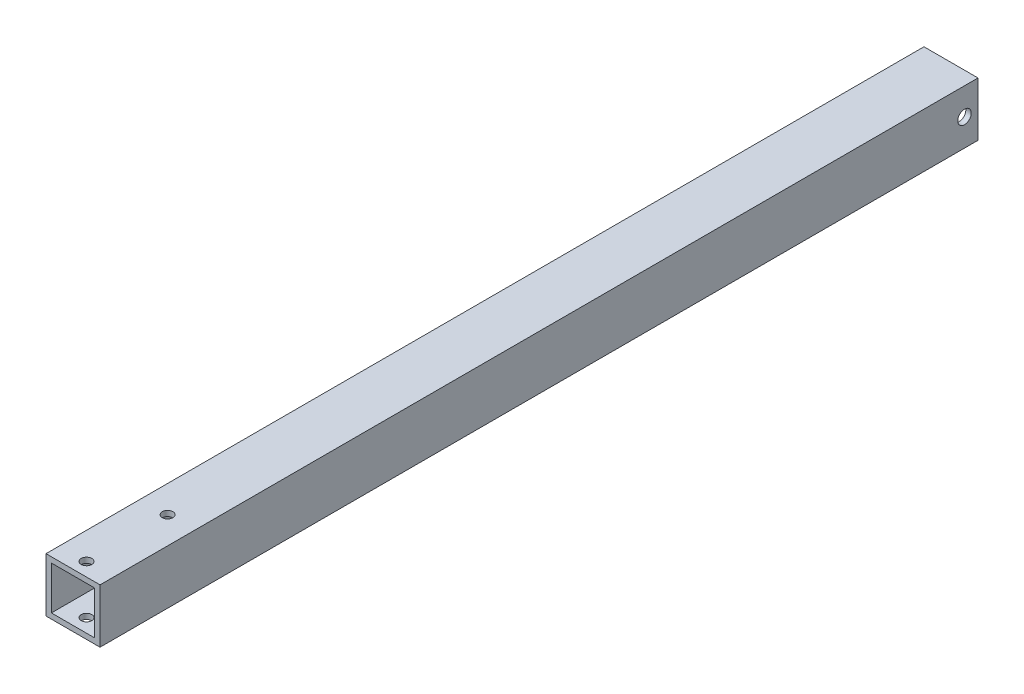
ISO-10303-21;
HEADER;
FILE_DESCRIPTION(('STEP AP214'),'2;1');
FILE_NAME('part.step','',(''),(''),'','','');
FILE_SCHEMA(('AUTOMOTIVE_DESIGN { 1 0 10303 214 1 1 1 1 }'));
ENDSEC;
DATA;
#1=APPLICATION_CONTEXT('core data for automotive mechanical design processes');
#2=APPLICATION_PROTOCOL_DEFINITION('international standard','automotive_design',2000,#1);
#3=PRODUCT_CONTEXT('',#1,'mechanical');
#4=PRODUCT('Part','Part','',(#3));
#5=PRODUCT_RELATED_PRODUCT_CATEGORY('part','',(#4));
#6=PRODUCT_DEFINITION_FORMATION('','',#4);
#7=PRODUCT_DEFINITION_CONTEXT('part definition',#1,'design');
#8=PRODUCT_DEFINITION('design','',#6,#7);
#9=PRODUCT_DEFINITION_SHAPE('','',#8);
#10=(LENGTH_UNIT() NAMED_UNIT(*) SI_UNIT(.MILLI.,.METRE.));
#11=(NAMED_UNIT(*) PLANE_ANGLE_UNIT() SI_UNIT($,.RADIAN.));
#12=(NAMED_UNIT(*) SI_UNIT($,.STERADIAN.) SOLID_ANGLE_UNIT());
#13=UNCERTAINTY_MEASURE_WITH_UNIT(LENGTH_MEASURE(1.E-05),#10,'distance_accuracy_value','');
#14=(GEOMETRIC_REPRESENTATION_CONTEXT(3) GLOBAL_UNCERTAINTY_ASSIGNED_CONTEXT((#13)) GLOBAL_UNIT_ASSIGNED_CONTEXT((#10,
#11,#12)) REPRESENTATION_CONTEXT('',''));
#15=CARTESIAN_POINT('',(0.,0.,0.));
#16=DIRECTION('',(0.,0.,1.));
#17=DIRECTION('',(1.,0.,0.));
#18=AXIS2_PLACEMENT_3D('',#15,#16,#17);
#19=CARTESIAN_POINT('',(0.,0.,412.75));
#20=DIRECTION('',(0.,0.,1.));
#21=DIRECTION('',(1.,0.,0.));
#22=AXIS2_PLACEMENT_3D('',#19,#20,#21);
#23=PLANE('',#22);
#24=DIRECTION('',(0.,1.,0.));
#25=VECTOR('',#24,1.);
#26=CARTESIAN_POINT('',(12.7,12.7,412.75));
#27=LINE('',#26,#25);
#28=CARTESIAN_POINT('',(12.7,-12.7,412.75));
#29=VERTEX_POINT('',#28);
#30=CARTESIAN_POINT('',(12.7,12.7,412.75));
#31=VERTEX_POINT('',#30);
#32=EDGE_CURVE('E163',#29,#31,#27,.T.);
#33=ORIENTED_EDGE('',*,*,#32,.T.);
#34=DIRECTION('',(-1.,0.,0.));
#35=VECTOR('',#34,1.);
#36=CARTESIAN_POINT('',(-12.7,12.7,412.75));
#37=LINE('',#36,#35);
#38=CARTESIAN_POINT('',(-12.7,12.7,412.75));
#39=VERTEX_POINT('',#38);
#40=EDGE_CURVE('E166',#31,#39,#37,.T.);
#41=ORIENTED_EDGE('',*,*,#40,.T.);
#42=DIRECTION('',(0.,-1.,0.));
#43=VECTOR('',#42,1.);
#44=CARTESIAN_POINT('',(-12.7,12.7,412.75));
#45=LINE('',#44,#43);
#46=CARTESIAN_POINT('',(-12.7,-12.7,412.75));
#47=VERTEX_POINT('',#46);
#48=EDGE_CURVE('E169',#39,#47,#45,.T.);
#49=ORIENTED_EDGE('',*,*,#48,.T.);
#50=DIRECTION('',(1.,0.,0.));
#51=VECTOR('',#50,1.);
#52=CARTESIAN_POINT('',(-12.7,-12.7,412.75));
#53=LINE('',#52,#51);
#54=EDGE_CURVE('E171',#47,#29,#53,.T.);
#55=ORIENTED_EDGE('',*,*,#54,.T.);
#56=EDGE_LOOP('',(#33,#41,#49,#55));
#57=FACE_BOUND('',#56,.T.);
#58=DIRECTION('',(-1.,0.,0.));
#59=VECTOR('',#58,1.);
#60=CARTESIAN_POINT('',(-12.7,10.16,412.75));
#61=LINE('',#60,#59);
#62=CARTESIAN_POINT('',(10.16,10.16,412.75));
#63=VERTEX_POINT('',#62);
#64=CARTESIAN_POINT('',(-10.16,10.16,412.75));
#65=VERTEX_POINT('',#64);
#66=EDGE_CURVE('E133',#63,#65,#61,.T.);
#67=ORIENTED_EDGE('',*,*,#66,.F.);
#68=DIRECTION('',(0.,1.,0.));
#69=VECTOR('',#68,1.);
#70=CARTESIAN_POINT('',(10.16,12.7,412.75));
#71=LINE('',#70,#69);
#72=CARTESIAN_POINT('',(10.16,-10.16,412.75));
#73=VERTEX_POINT('',#72);
#74=EDGE_CURVE('E125',#73,#63,#71,.T.);
#75=ORIENTED_EDGE('',*,*,#74,.F.);
#76=DIRECTION('',(1.,0.,0.));
#77=VECTOR('',#76,1.);
#78=CARTESIAN_POINT('',(-12.7,-10.16,412.75));
#79=LINE('',#78,#77);
#80=CARTESIAN_POINT('',(-10.16,-10.16,412.75));
#81=VERTEX_POINT('',#80);
#82=EDGE_CURVE('E147',#81,#73,#79,.T.);
#83=ORIENTED_EDGE('',*,*,#82,.F.);
#84=DIRECTION('',(0.,-1.,0.));
#85=VECTOR('',#84,1.);
#86=CARTESIAN_POINT('',(-10.16,12.7,412.75));
#87=LINE('',#86,#85);
#88=EDGE_CURVE('E145',#65,#81,#87,.T.);
#89=ORIENTED_EDGE('',*,*,#88,.F.);
#90=EDGE_LOOP('',(#67,#75,#83,#89));
#91=FACE_BOUND('',#90,.T.);
#92=ADVANCED_FACE('F58',(#57,#91),#23,.T.);
#93=CARTESIAN_POINT('',(0.,0.,0.));
#94=DIRECTION('',(0.,0.,1.));
#95=DIRECTION('',(1.,0.,0.));
#96=AXIS2_PLACEMENT_3D('',#93,#94,#95);
#97=PLANE('',#96);
#98=DIRECTION('',(0.,1.,0.));
#99=VECTOR('',#98,1.);
#100=CARTESIAN_POINT('',(12.7,12.7,0.));
#101=LINE('',#100,#99);
#102=CARTESIAN_POINT('',(12.7,-12.7,0.));
#103=VERTEX_POINT('',#102);
#104=CARTESIAN_POINT('',(12.7,12.7,0.));
#105=VERTEX_POINT('',#104);
#106=EDGE_CURVE('E141',#103,#105,#101,.T.);
#107=ORIENTED_EDGE('',*,*,#106,.F.);
#108=DIRECTION('',(1.,0.,0.));
#109=VECTOR('',#108,1.);
#110=CARTESIAN_POINT('',(-12.7,-12.7,0.));
#111=LINE('',#110,#109);
#112=CARTESIAN_POINT('',(-12.7,-12.7,0.));
#113=VERTEX_POINT('',#112);
#114=EDGE_CURVE('E167',#113,#103,#111,.T.);
#115=ORIENTED_EDGE('',*,*,#114,.F.);
#116=DIRECTION('',(0.,-1.,0.));
#117=VECTOR('',#116,1.);
#118=CARTESIAN_POINT('',(-12.7,12.7,0.));
#119=LINE('',#118,#117);
#120=CARTESIAN_POINT('',(-12.7,12.7,0.));
#121=VERTEX_POINT('',#120);
#122=EDGE_CURVE('E178',#121,#113,#119,.T.);
#123=ORIENTED_EDGE('',*,*,#122,.F.);
#124=DIRECTION('',(-1.,0.,0.));
#125=VECTOR('',#124,1.);
#126=CARTESIAN_POINT('',(-12.7,12.7,0.));
#127=LINE('',#126,#125);
#128=EDGE_CURVE('E176',#105,#121,#127,.T.);
#129=ORIENTED_EDGE('',*,*,#128,.F.);
#130=EDGE_LOOP('',(#107,#115,#123,#129));
#131=FACE_BOUND('',#130,.T.);
#132=DIRECTION('',(0.,1.,0.));
#133=VECTOR('',#132,1.);
#134=CARTESIAN_POINT('',(10.16,12.7,0.));
#135=LINE('',#134,#133);
#136=CARTESIAN_POINT('',(10.16,-10.16,0.));
#137=VERTEX_POINT('',#136);
#138=CARTESIAN_POINT('',(10.16,10.16,0.));
#139=VERTEX_POINT('',#138);
#140=EDGE_CURVE('E83',#137,#139,#135,.T.);
#141=ORIENTED_EDGE('',*,*,#140,.T.);
#142=DIRECTION('',(-1.,0.,0.));
#143=VECTOR('',#142,1.);
#144=CARTESIAN_POINT('',(-12.7,10.16,0.));
#145=LINE('',#144,#143);
#146=CARTESIAN_POINT('',(-10.16,10.16,0.));
#147=VERTEX_POINT('',#146);
#148=EDGE_CURVE('E140',#139,#147,#145,.T.);
#149=ORIENTED_EDGE('',*,*,#148,.T.);
#150=DIRECTION('',(0.,-1.,0.));
#151=VECTOR('',#150,1.);
#152=CARTESIAN_POINT('',(-10.16,12.7,0.));
#153=LINE('',#152,#151);
#154=CARTESIAN_POINT('',(-10.16,-10.16,0.));
#155=VERTEX_POINT('',#154);
#156=EDGE_CURVE('E155',#147,#155,#153,.T.);
#157=ORIENTED_EDGE('',*,*,#156,.T.);
#158=DIRECTION('',(1.,0.,0.));
#159=VECTOR('',#158,1.);
#160=CARTESIAN_POINT('',(-12.7,-10.16,0.));
#161=LINE('',#160,#159);
#162=EDGE_CURVE('E134',#155,#137,#161,.T.);
#163=ORIENTED_EDGE('',*,*,#162,.T.);
#164=EDGE_LOOP('',(#141,#149,#157,#163));
#165=FACE_BOUND('',#164,.T.);
#166=ADVANCED_FACE('F236',(#131,#165),#97,.F.);
#167=CARTESIAN_POINT('',(12.7,12.7,412.75));
#168=DIRECTION('',(-1.,0.,0.));
#169=DIRECTION('',(0.,-1.,0.));
#170=AXIS2_PLACEMENT_3D('',#167,#168,#169);
#171=PLANE('',#170);
#172=CARTESIAN_POINT('',(12.7,0.,6.35));
#173=DIRECTION('',(1.,0.,0.));
#174=DIRECTION('',(0.,1.,0.));
#175=AXIS2_PLACEMENT_3D('',#172,#173,#174);
#176=CIRCLE('',#175,3.175);
#177=CARTESIAN_POINT('',(12.7,3.175,6.35));
#178=VERTEX_POINT('',#177);
#179=EDGE_CURVE('E216',#178,#178,#176,.T.);
#180=ORIENTED_EDGE('',*,*,#179,.F.);
#181=EDGE_LOOP('',(#180));
#182=FACE_BOUND('',#181,.T.);
#183=ORIENTED_EDGE('',*,*,#106,.T.);
#184=DIRECTION('',(0.,0.,-1.));
#185=VECTOR('',#184,1.);
#186=CARTESIAN_POINT('',(12.7,12.7,412.75));
#187=LINE('',#186,#185);
#188=EDGE_CURVE('E12',#31,#105,#187,.T.);
#189=ORIENTED_EDGE('',*,*,#188,.F.);
#190=ORIENTED_EDGE('',*,*,#32,.F.);
#191=DIRECTION('',(0.,0.,-1.));
#192=VECTOR('',#191,1.);
#193=CARTESIAN_POINT('',(12.7,-12.7,412.75));
#194=LINE('',#193,#192);
#195=EDGE_CURVE('E173',#29,#103,#194,.T.);
#196=ORIENTED_EDGE('',*,*,#195,.T.);
#197=EDGE_LOOP('',(#183,#189,#190,#196));
#198=FACE_BOUND('',#197,.T.);
#199=ADVANCED_FACE('F60',(#182,#198),#171,.F.);
#200=CARTESIAN_POINT('',(-12.7,12.7,412.75));
#201=DIRECTION('',(0.,-1.,0.));
#202=DIRECTION('',(0.,0.,-1.));
#203=AXIS2_PLACEMENT_3D('',#200,#201,#202);
#204=PLANE('',#203);
#205=CARTESIAN_POINT('',(0.,12.7,406.4));
#206=DIRECTION('',(0.,1.,0.));
#207=DIRECTION('',(0.,0.,1.));
#208=AXIS2_PLACEMENT_3D('',#205,#206,#207);
#209=CIRCLE('',#208,2.48920000000001);
#210=CARTESIAN_POINT('',(0.,12.7,408.8892));
#211=VERTEX_POINT('',#210);
#212=EDGE_CURVE('E209',#211,#211,#209,.T.);
#213=ORIENTED_EDGE('',*,*,#212,.F.);
#214=EDGE_LOOP('',(#213));
#215=FACE_BOUND('',#214,.T.);
#216=CARTESIAN_POINT('',(0.,12.7,368.3));
#217=DIRECTION('',(0.,1.,0.));
#218=DIRECTION('',(0.,0.,1.));
#219=AXIS2_PLACEMENT_3D('',#216,#217,#218);
#220=CIRCLE('',#219,2.48920000000001);
#221=CARTESIAN_POINT('',(0.,12.7,370.7892));
#222=VERTEX_POINT('',#221);
#223=EDGE_CURVE('E202',#222,#222,#220,.T.);
#224=ORIENTED_EDGE('',*,*,#223,.F.);
#225=EDGE_LOOP('',(#224));
#226=FACE_BOUND('',#225,.T.);
#227=ORIENTED_EDGE('',*,*,#128,.T.);
#228=DIRECTION('',(0.,0.,-1.));
#229=VECTOR('',#228,1.);
#230=CARTESIAN_POINT('',(-12.7,12.7,412.75));
#231=LINE('',#230,#229);
#232=EDGE_CURVE('E67',#39,#121,#231,.T.);
#233=ORIENTED_EDGE('',*,*,#232,.F.);
#234=ORIENTED_EDGE('',*,*,#40,.F.);
#235=ORIENTED_EDGE('',*,*,#188,.T.);
#236=EDGE_LOOP('',(#227,#233,#234,#235));
#237=FACE_BOUND('',#236,.T.);
#238=ADVANCED_FACE('F266',(#215,#226,#237),#204,.F.);
#239=CARTESIAN_POINT('',(-12.7,12.7,412.75));
#240=DIRECTION('',(1.,0.,0.));
#241=DIRECTION('',(0.,1.,0.));
#242=AXIS2_PLACEMENT_3D('',#239,#240,#241);
#243=PLANE('',#242);
#244=CARTESIAN_POINT('',(-12.7,0.,6.35));
#245=DIRECTION('',(1.,0.,0.));
#246=DIRECTION('',(0.,1.,0.));
#247=AXIS2_PLACEMENT_3D('',#244,#245,#246);
#248=CIRCLE('',#247,3.175);
#249=CARTESIAN_POINT('',(-12.7,3.175,6.35));
#250=VERTEX_POINT('',#249);
#251=EDGE_CURVE('E219',#250,#250,#248,.T.);
#252=ORIENTED_EDGE('',*,*,#251,.T.);
#253=EDGE_LOOP('',(#252));
#254=FACE_BOUND('',#253,.T.);
#255=ORIENTED_EDGE('',*,*,#122,.T.);
#256=DIRECTION('',(0.,0.,-1.));
#257=VECTOR('',#256,1.);
#258=CARTESIAN_POINT('',(-12.7,-12.7,412.75));
#259=LINE('',#258,#257);
#260=EDGE_CURVE('E183',#47,#113,#259,.T.);
#261=ORIENTED_EDGE('',*,*,#260,.F.);
#262=ORIENTED_EDGE('',*,*,#48,.F.);
#263=ORIENTED_EDGE('',*,*,#232,.T.);
#264=EDGE_LOOP('',(#255,#261,#262,#263));
#265=FACE_BOUND('',#264,.T.);
#266=ADVANCED_FACE('F263',(#254,#265),#243,.F.);
#267=CARTESIAN_POINT('',(-12.7,-12.7,412.75));
#268=DIRECTION('',(0.,1.,0.));
#269=DIRECTION('',(0.,0.,1.));
#270=AXIS2_PLACEMENT_3D('',#267,#268,#269);
#271=PLANE('',#270);
#272=CARTESIAN_POINT('',(0.,-12.7,406.4));
#273=DIRECTION('',(0.,1.,0.));
#274=DIRECTION('',(0.,0.,1.));
#275=AXIS2_PLACEMENT_3D('',#272,#273,#274);
#276=CIRCLE('',#275,2.48920000000001);
#277=CARTESIAN_POINT('',(0.,-12.7,408.8892));
#278=VERTEX_POINT('',#277);
#279=EDGE_CURVE('E191',#278,#278,#276,.T.);
#280=ORIENTED_EDGE('',*,*,#279,.T.);
#281=EDGE_LOOP('',(#280));
#282=FACE_BOUND('',#281,.T.);
#283=CARTESIAN_POINT('',(0.,-12.7,368.3));
#284=DIRECTION('',(0.,1.,0.));
#285=DIRECTION('',(0.,0.,1.));
#286=AXIS2_PLACEMENT_3D('',#283,#284,#285);
#287=CIRCLE('',#286,2.48920000000001);
#288=CARTESIAN_POINT('',(0.,-12.7,370.7892));
#289=VERTEX_POINT('',#288);
#290=EDGE_CURVE('E205',#289,#289,#287,.T.);
#291=ORIENTED_EDGE('',*,*,#290,.T.);
#292=EDGE_LOOP('',(#291));
#293=FACE_BOUND('',#292,.T.);
#294=ORIENTED_EDGE('',*,*,#114,.T.);
#295=ORIENTED_EDGE('',*,*,#195,.F.);
#296=ORIENTED_EDGE('',*,*,#54,.F.);
#297=ORIENTED_EDGE('',*,*,#260,.T.);
#298=EDGE_LOOP('',(#294,#295,#296,#297));
#299=FACE_BOUND('',#298,.T.);
#300=ADVANCED_FACE('F260',(#282,#293,#299),#271,.F.);
#301=CARTESIAN_POINT('',(10.16,12.7,412.75));
#302=DIRECTION('',(-1.,0.,0.));
#303=DIRECTION('',(0.,-1.,0.));
#304=AXIS2_PLACEMENT_3D('',#301,#302,#303);
#305=PLANE('',#304);
#306=CARTESIAN_POINT('',(10.16,0.,6.35));
#307=DIRECTION('',(-1.,0.,0.));
#308=DIRECTION('',(0.,-1.,0.));
#309=AXIS2_PLACEMENT_3D('',#306,#307,#308);
#310=CIRCLE('',#309,3.175);
#311=CARTESIAN_POINT('',(10.16,-3.175,6.35));
#312=VERTEX_POINT('',#311);
#313=EDGE_CURVE('E206',#312,#312,#310,.T.);
#314=ORIENTED_EDGE('',*,*,#313,.F.);
#315=EDGE_LOOP('',(#314));
#316=FACE_BOUND('',#315,.T.);
#317=ORIENTED_EDGE('',*,*,#140,.F.);
#318=DIRECTION('',(0.,0.,-1.));
#319=VECTOR('',#318,1.);
#320=CARTESIAN_POINT('',(10.16,-10.16,412.75));
#321=LINE('',#320,#319);
#322=EDGE_CURVE('E129',#73,#137,#321,.T.);
#323=ORIENTED_EDGE('',*,*,#322,.F.);
#324=ORIENTED_EDGE('',*,*,#74,.T.);
#325=DIRECTION('',(0.,0.,-1.));
#326=VECTOR('',#325,1.);
#327=CARTESIAN_POINT('',(10.16,10.16,412.75));
#328=LINE('',#327,#326);
#329=EDGE_CURVE('E128',#63,#139,#328,.T.);
#330=ORIENTED_EDGE('',*,*,#329,.T.);
#331=EDGE_LOOP('',(#317,#323,#324,#330));
#332=FACE_BOUND('',#331,.T.);
#333=ADVANCED_FACE('F127',(#316,#332),#305,.T.);
#334=CARTESIAN_POINT('',(-12.7,10.16,412.75));
#335=DIRECTION('',(0.,-1.,0.));
#336=DIRECTION('',(0.,0.,-1.));
#337=AXIS2_PLACEMENT_3D('',#334,#335,#336);
#338=PLANE('',#337);
#339=CARTESIAN_POINT('',(0.,10.16,406.4));
#340=DIRECTION('',(0.,-1.,0.));
#341=DIRECTION('',(0.,0.,-1.));
#342=AXIS2_PLACEMENT_3D('',#339,#340,#341);
#343=CIRCLE('',#342,2.48920000000001);
#344=CARTESIAN_POINT('',(0.,10.16,403.9108));
#345=VERTEX_POINT('',#344);
#346=EDGE_CURVE('E153',#345,#345,#343,.T.);
#347=ORIENTED_EDGE('',*,*,#346,.F.);
#348=EDGE_LOOP('',(#347));
#349=FACE_BOUND('',#348,.T.);
#350=CARTESIAN_POINT('',(0.,10.16,368.3));
#351=DIRECTION('',(0.,-1.,0.));
#352=DIRECTION('',(0.,0.,-1.));
#353=AXIS2_PLACEMENT_3D('',#350,#351,#352);
#354=CIRCLE('',#353,2.48920000000001);
#355=CARTESIAN_POINT('',(0.,10.16,365.8108));
#356=VERTEX_POINT('',#355);
#357=EDGE_CURVE('E190',#356,#356,#354,.T.);
#358=ORIENTED_EDGE('',*,*,#357,.F.);
#359=EDGE_LOOP('',(#358));
#360=FACE_BOUND('',#359,.T.);
#361=ORIENTED_EDGE('',*,*,#148,.F.);
#362=ORIENTED_EDGE('',*,*,#329,.F.);
#363=ORIENTED_EDGE('',*,*,#66,.T.);
#364=DIRECTION('',(0.,0.,-1.));
#365=VECTOR('',#364,1.);
#366=CARTESIAN_POINT('',(-10.16,10.16,412.75));
#367=LINE('',#366,#365);
#368=EDGE_CURVE('E142',#65,#147,#367,.T.);
#369=ORIENTED_EDGE('',*,*,#368,.T.);
#370=EDGE_LOOP('',(#361,#362,#363,#369));
#371=FACE_BOUND('',#370,.T.);
#372=ADVANCED_FACE('F137',(#349,#360,#371),#338,.T.);
#373=CARTESIAN_POINT('',(-10.16,12.7,412.75));
#374=DIRECTION('',(1.,0.,0.));
#375=DIRECTION('',(0.,1.,0.));
#376=AXIS2_PLACEMENT_3D('',#373,#374,#375);
#377=PLANE('',#376);
#378=CARTESIAN_POINT('',(-10.16,0.,6.35));
#379=DIRECTION('',(1.,0.,0.));
#380=DIRECTION('',(0.,1.,0.));
#381=AXIS2_PLACEMENT_3D('',#378,#379,#380);
#382=CIRCLE('',#381,3.175);
#383=CARTESIAN_POINT('',(-10.16,3.175,6.35));
#384=VERTEX_POINT('',#383);
#385=EDGE_CURVE('E62',#384,#384,#382,.T.);
#386=ORIENTED_EDGE('',*,*,#385,.F.);
#387=EDGE_LOOP('',(#386));
#388=FACE_BOUND('',#387,.T.);
#389=ORIENTED_EDGE('',*,*,#156,.F.);
#390=ORIENTED_EDGE('',*,*,#368,.F.);
#391=ORIENTED_EDGE('',*,*,#88,.T.);
#392=DIRECTION('',(0.,0.,-1.));
#393=VECTOR('',#392,1.);
#394=CARTESIAN_POINT('',(-10.16,-10.16,412.75));
#395=LINE('',#394,#393);
#396=EDGE_CURVE('E75',#81,#155,#395,.T.);
#397=ORIENTED_EDGE('',*,*,#396,.T.);
#398=EDGE_LOOP('',(#389,#390,#391,#397));
#399=FACE_BOUND('',#398,.T.);
#400=ADVANCED_FACE('F229',(#388,#399),#377,.T.);
#401=CARTESIAN_POINT('',(-12.7,-10.16,412.75));
#402=DIRECTION('',(0.,1.,0.));
#403=DIRECTION('',(0.,0.,1.));
#404=AXIS2_PLACEMENT_3D('',#401,#402,#403);
#405=PLANE('',#404);
#406=CARTESIAN_POINT('',(0.,-10.16,406.4));
#407=DIRECTION('',(0.,1.,0.));
#408=DIRECTION('',(0.,0.,1.));
#409=AXIS2_PLACEMENT_3D('',#406,#407,#408);
#410=CIRCLE('',#409,2.48920000000001);
#411=CARTESIAN_POINT('',(0.,-10.16,408.8892));
#412=VERTEX_POINT('',#411);
#413=EDGE_CURVE('E192',#412,#412,#410,.T.);
#414=ORIENTED_EDGE('',*,*,#413,.F.);
#415=EDGE_LOOP('',(#414));
#416=FACE_BOUND('',#415,.T.);
#417=CARTESIAN_POINT('',(0.,-10.16,368.3));
#418=DIRECTION('',(0.,1.,0.));
#419=DIRECTION('',(0.,0.,1.));
#420=AXIS2_PLACEMENT_3D('',#417,#418,#419);
#421=CIRCLE('',#420,2.48920000000001);
#422=CARTESIAN_POINT('',(0.,-10.16,370.7892));
#423=VERTEX_POINT('',#422);
#424=EDGE_CURVE('E188',#423,#423,#421,.T.);
#425=ORIENTED_EDGE('',*,*,#424,.F.);
#426=EDGE_LOOP('',(#425));
#427=FACE_BOUND('',#426,.T.);
#428=ORIENTED_EDGE('',*,*,#162,.F.);
#429=ORIENTED_EDGE('',*,*,#396,.F.);
#430=ORIENTED_EDGE('',*,*,#82,.T.);
#431=ORIENTED_EDGE('',*,*,#322,.T.);
#432=EDGE_LOOP('',(#428,#429,#430,#431));
#433=FACE_BOUND('',#432,.T.);
#434=ADVANCED_FACE('F232',(#416,#427,#433),#405,.T.);
#435=CARTESIAN_POINT('',(0.,-12.7,368.3));
#436=DIRECTION('',(0.,1.,0.));
#437=DIRECTION('',(0.,0.,1.));
#438=AXIS2_PLACEMENT_3D('',#435,#436,#437);
#439=CYLINDRICAL_SURFACE('',#438,2.48920000000001);
#440=ORIENTED_EDGE('',*,*,#424,.T.);
#441=EDGE_LOOP('',(#440));
#442=FACE_BOUND('',#441,.T.);
#443=ORIENTED_EDGE('',*,*,#290,.F.);
#444=EDGE_LOOP('',(#443));
#445=FACE_BOUND('',#444,.T.);
#446=ADVANCED_FACE('F238',(#442,#445),#439,.F.);
#447=CARTESIAN_POINT('',(0.,-12.7,406.4));
#448=DIRECTION('',(0.,1.,0.));
#449=DIRECTION('',(0.,0.,1.));
#450=AXIS2_PLACEMENT_3D('',#447,#448,#449);
#451=CYLINDRICAL_SURFACE('',#450,2.48920000000001);
#452=ORIENTED_EDGE('',*,*,#413,.T.);
#453=EDGE_LOOP('',(#452));
#454=FACE_BOUND('',#453,.T.);
#455=ORIENTED_EDGE('',*,*,#279,.F.);
#456=EDGE_LOOP('',(#455));
#457=FACE_BOUND('',#456,.T.);
#458=ADVANCED_FACE('F244',(#454,#457),#451,.F.);
#459=ORIENTED_EDGE('',*,*,#357,.T.);
#460=EDGE_LOOP('',(#459));
#461=FACE_BOUND('',#460,.T.);
#462=ORIENTED_EDGE('',*,*,#223,.T.);
#463=EDGE_LOOP('',(#462));
#464=FACE_BOUND('',#463,.T.);
#465=ADVANCED_FACE('F247',(#461,#464),#439,.F.);
#466=ORIENTED_EDGE('',*,*,#346,.T.);
#467=EDGE_LOOP('',(#466));
#468=FACE_BOUND('',#467,.T.);
#469=ORIENTED_EDGE('',*,*,#212,.T.);
#470=EDGE_LOOP('',(#469));
#471=FACE_BOUND('',#470,.T.);
#472=ADVANCED_FACE('F292',(#468,#471),#451,.F.);
#473=CARTESIAN_POINT('',(-12.7,0.,6.35));
#474=DIRECTION('',(1.,0.,0.));
#475=DIRECTION('',(0.,1.,0.));
#476=AXIS2_PLACEMENT_3D('',#473,#474,#475);
#477=CYLINDRICAL_SURFACE('',#476,3.175);
#478=ORIENTED_EDGE('',*,*,#385,.T.);
#479=EDGE_LOOP('',(#478));
#480=FACE_BOUND('',#479,.T.);
#481=ORIENTED_EDGE('',*,*,#251,.F.);
#482=EDGE_LOOP('',(#481));
#483=FACE_BOUND('',#482,.T.);
#484=ADVANCED_FACE('F226',(#480,#483),#477,.F.);
#485=ORIENTED_EDGE('',*,*,#313,.T.);
#486=EDGE_LOOP('',(#485));
#487=FACE_BOUND('',#486,.T.);
#488=ORIENTED_EDGE('',*,*,#179,.T.);
#489=EDGE_LOOP('',(#488));
#490=FACE_BOUND('',#489,.T.);
#491=ADVANCED_FACE('F301',(#487,#490),#477,.F.);
#492=CLOSED_SHELL('',(#92,#166,#199,#238,#266,#300,#333,#372,#400,#434,#446,#458,#465,#472,#484,#491));
#493=MANIFOLD_SOLID_BREP('B2',#492);
#494=ADVANCED_BREP_SHAPE_REPRESENTATION('',(#18,#493),#14);
#495=SHAPE_DEFINITION_REPRESENTATION(#9,#494);
ENDSEC;
END-ISO-10303-21;
